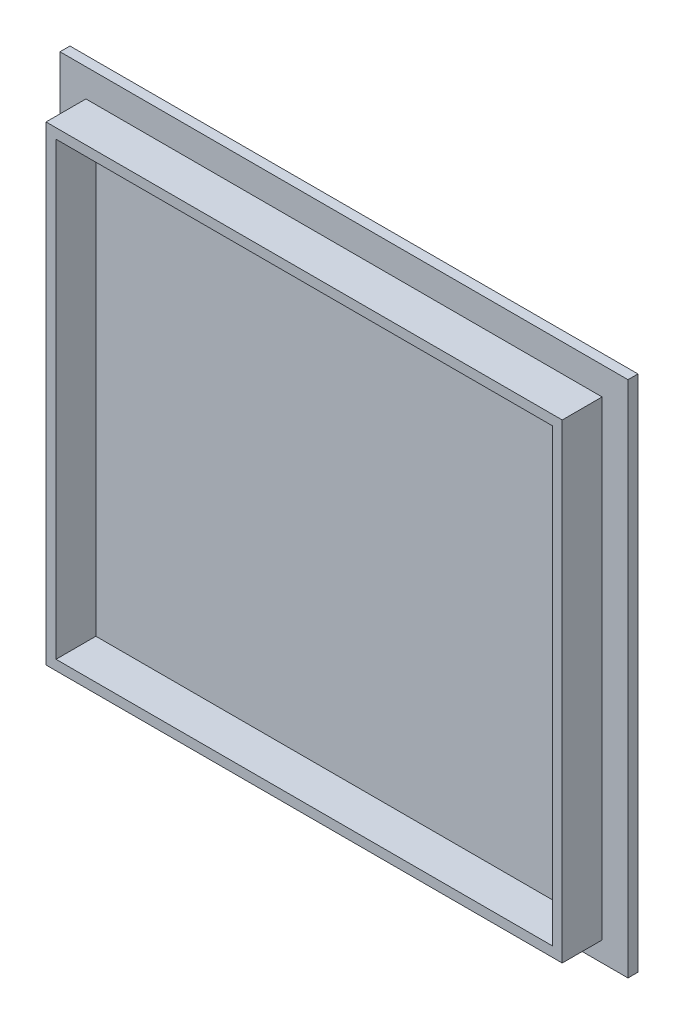
ISO-10303-21;
HEADER;
FILE_DESCRIPTION(('STEP AP214'),'2;1');
FILE_NAME('part.step','',(''),(''),'','','');
FILE_SCHEMA(('AUTOMOTIVE_DESIGN { 1 0 10303 214 1 1 1 1 }'));
ENDSEC;
DATA;
#1=APPLICATION_CONTEXT('core data for automotive mechanical design processes');
#2=APPLICATION_PROTOCOL_DEFINITION('international standard','automotive_design',2000,#1);
#3=PRODUCT_CONTEXT('',#1,'mechanical');
#4=PRODUCT('Part','Part','',(#3));
#5=PRODUCT_RELATED_PRODUCT_CATEGORY('part','',(#4));
#6=PRODUCT_DEFINITION_FORMATION('','',#4);
#7=PRODUCT_DEFINITION_CONTEXT('part definition',#1,'design');
#8=PRODUCT_DEFINITION('design','',#6,#7);
#9=PRODUCT_DEFINITION_SHAPE('','',#8);
#10=(LENGTH_UNIT() NAMED_UNIT(*) SI_UNIT(.MILLI.,.METRE.));
#11=(NAMED_UNIT(*) PLANE_ANGLE_UNIT() SI_UNIT($,.RADIAN.));
#12=(NAMED_UNIT(*) SI_UNIT($,.STERADIAN.) SOLID_ANGLE_UNIT());
#13=UNCERTAINTY_MEASURE_WITH_UNIT(LENGTH_MEASURE(1.E-05),#10,'distance_accuracy_value','');
#14=(GEOMETRIC_REPRESENTATION_CONTEXT(3) GLOBAL_UNCERTAINTY_ASSIGNED_CONTEXT((#13)) GLOBAL_UNIT_ASSIGNED_CONTEXT((#10,
#11,#12)) REPRESENTATION_CONTEXT('',''));
#15=CARTESIAN_POINT('',(0.,0.,0.));
#16=DIRECTION('',(0.,0.,1.));
#17=DIRECTION('',(1.,0.,0.));
#18=AXIS2_PLACEMENT_3D('',#15,#16,#17);
#19=CARTESIAN_POINT('',(-121.814520335947,173.047709923664,5.));
#20=DIRECTION('',(1.,0.,0.));
#21=DIRECTION('',(0.,1.,0.));
#22=AXIS2_PLACEMENT_3D('',#19,#20,#21);
#23=PLANE('',#22);
#24=DIRECTION('',(0.,-1.,0.));
#25=VECTOR('',#24,1.);
#26=CARTESIAN_POINT('',(-121.814520335947,173.047709923664,0.));
#27=LINE('',#26,#25);
#28=CARTESIAN_POINT('',(-121.814520335947,173.047709923664,0.));
#29=VERTEX_POINT('',#28);
#30=CARTESIAN_POINT('',(-121.814520335947,-86.9522900763359,0.));
#31=VERTEX_POINT('',#30);
#32=EDGE_CURVE('E195',#29,#31,#27,.T.);
#33=ORIENTED_EDGE('',*,*,#32,.T.);
#34=DIRECTION('',(0.,0.,-1.));
#35=VECTOR('',#34,1.);
#36=CARTESIAN_POINT('',(-121.814520335947,-86.9522900763359,5.));
#37=LINE('',#36,#35);
#38=CARTESIAN_POINT('',(-121.814520335947,-86.9522900763359,5.));
#39=VERTEX_POINT('',#38);
#40=EDGE_CURVE('E11',#39,#31,#37,.T.);
#41=ORIENTED_EDGE('',*,*,#40,.F.);
#42=DIRECTION('',(0.,-1.,0.));
#43=VECTOR('',#42,1.);
#44=CARTESIAN_POINT('',(-121.814520335947,173.047709923664,5.));
#45=LINE('',#44,#43);
#46=CARTESIAN_POINT('',(-121.814520335947,173.047709923664,5.));
#47=VERTEX_POINT('',#46);
#48=EDGE_CURVE('E196',#47,#39,#45,.T.);
#49=ORIENTED_EDGE('',*,*,#48,.F.);
#50=DIRECTION('',(0.,0.,-1.));
#51=VECTOR('',#50,1.);
#52=CARTESIAN_POINT('',(-121.814520335947,173.047709923664,5.));
#53=LINE('',#52,#51);
#54=EDGE_CURVE('E206',#47,#29,#53,.T.);
#55=ORIENTED_EDGE('',*,*,#54,.T.);
#56=EDGE_LOOP('',(#33,#41,#49,#55));
#57=FACE_BOUND('',#56,.T.);
#58=ADVANCED_FACE('F39',(#57),#23,.F.);
#59=CARTESIAN_POINT('',(-121.814520335947,-86.9522900763359,5.));
#60=DIRECTION('',(0.,1.,0.));
#61=DIRECTION('',(0.,0.,1.));
#62=AXIS2_PLACEMENT_3D('',#59,#60,#61);
#63=PLANE('',#62);
#64=DIRECTION('',(1.,0.,0.));
#65=VECTOR('',#64,1.);
#66=CARTESIAN_POINT('',(-121.814520335947,-86.9522900763359,0.));
#67=LINE('',#66,#65);
#68=CARTESIAN_POINT('',(163.185479664053,-86.9522900763359,0.));
#69=VERTEX_POINT('',#68);
#70=EDGE_CURVE('E209',#31,#69,#67,.T.);
#71=ORIENTED_EDGE('',*,*,#70,.T.);
#72=DIRECTION('',(0.,0.,-1.));
#73=VECTOR('',#72,1.);
#74=CARTESIAN_POINT('',(163.185479664053,-86.9522900763359,5.));
#75=LINE('',#74,#73);
#76=CARTESIAN_POINT('',(163.185479664053,-86.9522900763359,5.));
#77=VERTEX_POINT('',#76);
#78=EDGE_CURVE('E46',#77,#69,#75,.T.);
#79=ORIENTED_EDGE('',*,*,#78,.F.);
#80=DIRECTION('',(1.,0.,0.));
#81=VECTOR('',#80,1.);
#82=CARTESIAN_POINT('',(-121.814520335947,-86.9522900763359,5.));
#83=LINE('',#82,#81);
#84=EDGE_CURVE('E199',#39,#77,#83,.T.);
#85=ORIENTED_EDGE('',*,*,#84,.F.);
#86=ORIENTED_EDGE('',*,*,#40,.T.);
#87=EDGE_LOOP('',(#71,#79,#85,#86));
#88=FACE_BOUND('',#87,.T.);
#89=ADVANCED_FACE('F239',(#88),#63,.F.);
#90=CARTESIAN_POINT('',(163.185479664052,173.047709923664,5.));
#91=DIRECTION('',(-1.,0.,0.));
#92=DIRECTION('',(0.,-1.,0.));
#93=AXIS2_PLACEMENT_3D('',#90,#91,#92);
#94=PLANE('',#93);
#95=DIRECTION('',(0.,1.,0.));
#96=VECTOR('',#95,1.);
#97=CARTESIAN_POINT('',(163.185479664052,173.047709923664,0.));
#98=LINE('',#97,#96);
#99=CARTESIAN_POINT('',(163.185479664052,173.047709923664,0.));
#100=VERTEX_POINT('',#99);
#101=EDGE_CURVE('E211',#69,#100,#98,.T.);
#102=ORIENTED_EDGE('',*,*,#101,.T.);
#103=DIRECTION('',(0.,0.,-1.));
#104=VECTOR('',#103,1.);
#105=CARTESIAN_POINT('',(163.185479664052,173.047709923664,5.));
#106=LINE('',#105,#104);
#107=CARTESIAN_POINT('',(163.185479664052,173.047709923664,5.));
#108=VERTEX_POINT('',#107);
#109=EDGE_CURVE('E216',#108,#100,#106,.T.);
#110=ORIENTED_EDGE('',*,*,#109,.F.);
#111=DIRECTION('',(0.,1.,0.));
#112=VECTOR('',#111,1.);
#113=CARTESIAN_POINT('',(163.185479664052,173.047709923664,5.));
#114=LINE('',#113,#112);
#115=EDGE_CURVE('E202',#77,#108,#114,.T.);
#116=ORIENTED_EDGE('',*,*,#115,.F.);
#117=ORIENTED_EDGE('',*,*,#78,.T.);
#118=EDGE_LOOP('',(#102,#110,#116,#117));
#119=FACE_BOUND('',#118,.T.);
#120=ADVANCED_FACE('F223',(#119),#94,.F.);
#121=CARTESIAN_POINT('',(-121.814520335947,173.047709923664,5.));
#122=DIRECTION('',(0.,-1.,0.));
#123=DIRECTION('',(0.,0.,-1.));
#124=AXIS2_PLACEMENT_3D('',#121,#122,#123);
#125=PLANE('',#124);
#126=DIRECTION('',(-1.,0.,0.));
#127=VECTOR('',#126,1.);
#128=CARTESIAN_POINT('',(-121.814520335947,173.047709923664,0.));
#129=LINE('',#128,#127);
#130=EDGE_CURVE('E200',#100,#29,#129,.T.);
#131=ORIENTED_EDGE('',*,*,#130,.T.);
#132=ORIENTED_EDGE('',*,*,#54,.F.);
#133=DIRECTION('',(-1.,0.,0.));
#134=VECTOR('',#133,1.);
#135=CARTESIAN_POINT('',(-121.814520335947,173.047709923664,5.));
#136=LINE('',#135,#134);
#137=EDGE_CURVE('E204',#108,#47,#136,.T.);
#138=ORIENTED_EDGE('',*,*,#137,.F.);
#139=ORIENTED_EDGE('',*,*,#109,.T.);
#140=EDGE_LOOP('',(#131,#132,#138,#139));
#141=FACE_BOUND('',#140,.T.);
#142=ADVANCED_FACE('F232',(#141),#125,.F.);
#143=CARTESIAN_POINT('',(0.,0.,5.));
#144=DIRECTION('',(0.,0.,1.));
#145=DIRECTION('',(1.,0.,0.));
#146=AXIS2_PLACEMENT_3D('',#143,#144,#145);
#147=PLANE('',#146);
#148=DIRECTION('',(0.,-1.,0.));
#149=VECTOR('',#148,1.);
#150=CARTESIAN_POINT('',(-108.814520335947,159.047709923664,5.));
#151=LINE('',#150,#149);
#152=CARTESIAN_POINT('',(-108.814520335947,159.047709923664,5.));
#153=VERTEX_POINT('',#152);
#154=CARTESIAN_POINT('',(-108.814520335947,-76.9522900763359,5.));
#155=VERTEX_POINT('',#154);
#156=EDGE_CURVE('E61',#153,#155,#151,.T.);
#157=ORIENTED_EDGE('',*,*,#156,.F.);
#158=DIRECTION('',(-1.,0.,0.));
#159=VECTOR('',#158,1.);
#160=CARTESIAN_POINT('',(-108.814520335947,159.047709923664,5.));
#161=LINE('',#160,#159);
#162=CARTESIAN_POINT('',(150.185479664053,159.047709923664,5.));
#163=VERTEX_POINT('',#162);
#164=EDGE_CURVE('E169',#163,#153,#161,.T.);
#165=ORIENTED_EDGE('',*,*,#164,.F.);
#166=DIRECTION('',(0.,1.,0.));
#167=VECTOR('',#166,1.);
#168=CARTESIAN_POINT('',(150.185479664053,159.047709923664,5.));
#169=LINE('',#168,#167);
#170=CARTESIAN_POINT('',(150.185479664053,-76.9522900763359,5.));
#171=VERTEX_POINT('',#170);
#172=EDGE_CURVE('E180',#171,#163,#169,.T.);
#173=ORIENTED_EDGE('',*,*,#172,.F.);
#174=DIRECTION('',(1.,0.,0.));
#175=VECTOR('',#174,1.);
#176=CARTESIAN_POINT('',(-108.814520335947,-76.9522900763359,5.));
#177=LINE('',#176,#175);
#178=EDGE_CURVE('E177',#155,#171,#177,.T.);
#179=ORIENTED_EDGE('',*,*,#178,.F.);
#180=EDGE_LOOP('',(#157,#165,#173,#179));
#181=FACE_BOUND('',#180,.T.);
#182=ORIENTED_EDGE('',*,*,#48,.T.);
#183=ORIENTED_EDGE('',*,*,#84,.T.);
#184=ORIENTED_EDGE('',*,*,#115,.T.);
#185=ORIENTED_EDGE('',*,*,#137,.T.);
#186=EDGE_LOOP('',(#182,#183,#184,#185));
#187=FACE_BOUND('',#186,.T.);
#188=ADVANCED_FACE('F238',(#181,#187),#147,.T.);
#189=CARTESIAN_POINT('',(0.,0.,0.));
#190=DIRECTION('',(0.,0.,1.));
#191=DIRECTION('',(1.,0.,0.));
#192=AXIS2_PLACEMENT_3D('',#189,#190,#191);
#193=PLANE('',#192);
#194=ORIENTED_EDGE('',*,*,#32,.F.);
#195=ORIENTED_EDGE('',*,*,#130,.F.);
#196=ORIENTED_EDGE('',*,*,#101,.F.);
#197=ORIENTED_EDGE('',*,*,#70,.F.);
#198=EDGE_LOOP('',(#194,#195,#196,#197));
#199=FACE_BOUND('',#198,.T.);
#200=ADVANCED_FACE('F229',(#199),#193,.F.);
#201=CARTESIAN_POINT('',(-108.814520335947,159.047709923664,25.));
#202=DIRECTION('',(1.,0.,0.));
#203=DIRECTION('',(0.,1.,0.));
#204=AXIS2_PLACEMENT_3D('',#201,#202,#203);
#205=PLANE('',#204);
#206=ORIENTED_EDGE('',*,*,#156,.T.);
#207=DIRECTION('',(0.,0.,-1.));
#208=VECTOR('',#207,1.);
#209=CARTESIAN_POINT('',(-108.814520335947,-76.9522900763359,25.));
#210=LINE('',#209,#208);
#211=CARTESIAN_POINT('',(-108.814520335947,-76.9522900763359,25.));
#212=VERTEX_POINT('',#211);
#213=EDGE_CURVE('E192',#212,#155,#210,.T.);
#214=ORIENTED_EDGE('',*,*,#213,.F.);
#215=DIRECTION('',(0.,-1.,0.));
#216=VECTOR('',#215,1.);
#217=CARTESIAN_POINT('',(-108.814520335947,159.047709923664,25.));
#218=LINE('',#217,#216);
#219=CARTESIAN_POINT('',(-108.814520335947,159.047709923664,25.));
#220=VERTEX_POINT('',#219);
#221=EDGE_CURVE('E165',#220,#212,#218,.T.);
#222=ORIENTED_EDGE('',*,*,#221,.F.);
#223=DIRECTION('',(0.,0.,-1.));
#224=VECTOR('',#223,1.);
#225=CARTESIAN_POINT('',(-108.814520335947,159.047709923664,25.));
#226=LINE('',#225,#224);
#227=EDGE_CURVE('E175',#220,#153,#226,.T.);
#228=ORIENTED_EDGE('',*,*,#227,.T.);
#229=EDGE_LOOP('',(#206,#214,#222,#228));
#230=FACE_BOUND('',#229,.T.);
#231=ADVANCED_FACE('F251',(#230),#205,.F.);
#232=CARTESIAN_POINT('',(-108.814520335947,-76.9522900763359,25.));
#233=DIRECTION('',(0.,1.,0.));
#234=DIRECTION('',(0.,0.,1.));
#235=AXIS2_PLACEMENT_3D('',#232,#233,#234);
#236=PLANE('',#235);
#237=ORIENTED_EDGE('',*,*,#178,.T.);
#238=DIRECTION('',(0.,0.,-1.));
#239=VECTOR('',#238,1.);
#240=CARTESIAN_POINT('',(150.185479664053,-76.9522900763359,25.));
#241=LINE('',#240,#239);
#242=CARTESIAN_POINT('',(150.185479664053,-76.9522900763359,25.));
#243=VERTEX_POINT('',#242);
#244=EDGE_CURVE('E189',#243,#171,#241,.T.);
#245=ORIENTED_EDGE('',*,*,#244,.F.);
#246=DIRECTION('',(1.,0.,0.));
#247=VECTOR('',#246,1.);
#248=CARTESIAN_POINT('',(-108.814520335947,-76.9522900763359,25.));
#249=LINE('',#248,#247);
#250=EDGE_CURVE('E168',#212,#243,#249,.T.);
#251=ORIENTED_EDGE('',*,*,#250,.F.);
#252=ORIENTED_EDGE('',*,*,#213,.T.);
#253=EDGE_LOOP('',(#237,#245,#251,#252));
#254=FACE_BOUND('',#253,.T.);
#255=ADVANCED_FACE('F256',(#254),#236,.F.);
#256=CARTESIAN_POINT('',(150.185479664053,159.047709923664,25.));
#257=DIRECTION('',(-1.,0.,0.));
#258=DIRECTION('',(0.,-1.,0.));
#259=AXIS2_PLACEMENT_3D('',#256,#257,#258);
#260=PLANE('',#259);
#261=ORIENTED_EDGE('',*,*,#172,.T.);
#262=DIRECTION('',(0.,0.,-1.));
#263=VECTOR('',#262,1.);
#264=CARTESIAN_POINT('',(150.185479664053,159.047709923664,25.));
#265=LINE('',#264,#263);
#266=CARTESIAN_POINT('',(150.185479664053,159.047709923664,25.));
#267=VERTEX_POINT('',#266);
#268=EDGE_CURVE('E186',#267,#163,#265,.T.);
#269=ORIENTED_EDGE('',*,*,#268,.F.);
#270=DIRECTION('',(0.,1.,0.));
#271=VECTOR('',#270,1.);
#272=CARTESIAN_POINT('',(150.185479664053,159.047709923664,25.));
#273=LINE('',#272,#271);
#274=EDGE_CURVE('E171',#243,#267,#273,.T.);
#275=ORIENTED_EDGE('',*,*,#274,.F.);
#276=ORIENTED_EDGE('',*,*,#244,.T.);
#277=EDGE_LOOP('',(#261,#269,#275,#276));
#278=FACE_BOUND('',#277,.T.);
#279=ADVANCED_FACE('F260',(#278),#260,.F.);
#280=CARTESIAN_POINT('',(-108.814520335947,159.047709923664,25.));
#281=DIRECTION('',(0.,-1.,0.));
#282=DIRECTION('',(0.,0.,-1.));
#283=AXIS2_PLACEMENT_3D('',#280,#281,#282);
#284=PLANE('',#283);
#285=ORIENTED_EDGE('',*,*,#164,.T.);
#286=ORIENTED_EDGE('',*,*,#227,.F.);
#287=DIRECTION('',(-1.,0.,0.));
#288=VECTOR('',#287,1.);
#289=CARTESIAN_POINT('',(-108.814520335947,159.047709923664,25.));
#290=LINE('',#289,#288);
#291=EDGE_CURVE('E173',#267,#220,#290,.T.);
#292=ORIENTED_EDGE('',*,*,#291,.F.);
#293=ORIENTED_EDGE('',*,*,#268,.T.);
#294=EDGE_LOOP('',(#285,#286,#292,#293));
#295=FACE_BOUND('',#294,.T.);
#296=ADVANCED_FACE('F264',(#295),#284,.F.);
#297=CARTESIAN_POINT('',(0.,0.,25.));
#298=DIRECTION('',(0.,0.,1.));
#299=DIRECTION('',(1.,0.,0.));
#300=AXIS2_PLACEMENT_3D('',#297,#298,#299);
#301=PLANE('',#300);
#302=DIRECTION('',(0.,-1.,0.));
#303=VECTOR('',#302,1.);
#304=CARTESIAN_POINT('',(-103.814520335947,154.047709923664,25.));
#305=LINE('',#304,#303);
#306=CARTESIAN_POINT('',(-103.814520335947,154.047709923664,25.));
#307=VERTEX_POINT('',#306);
#308=CARTESIAN_POINT('',(-103.814520335947,-71.9522900763359,25.));
#309=VERTEX_POINT('',#308);
#310=EDGE_CURVE('E53',#307,#309,#305,.T.);
#311=ORIENTED_EDGE('',*,*,#310,.F.);
#312=DIRECTION('',(-1.,0.,0.));
#313=VECTOR('',#312,1.);
#314=CARTESIAN_POINT('',(-103.814520335947,154.047709923664,25.));
#315=LINE('',#314,#313);
#316=CARTESIAN_POINT('',(145.185479664053,154.047709923664,25.));
#317=VERTEX_POINT('',#316);
#318=EDGE_CURVE('E147',#317,#307,#315,.T.);
#319=ORIENTED_EDGE('',*,*,#318,.F.);
#320=DIRECTION('',(0.,1.,0.));
#321=VECTOR('',#320,1.);
#322=CARTESIAN_POINT('',(145.185479664053,154.047709923664,25.));
#323=LINE('',#322,#321);
#324=CARTESIAN_POINT('',(145.185479664053,-71.9522900763359,25.));
#325=VERTEX_POINT('',#324);
#326=EDGE_CURVE('E150',#325,#317,#323,.T.);
#327=ORIENTED_EDGE('',*,*,#326,.F.);
#328=DIRECTION('',(1.,0.,0.));
#329=VECTOR('',#328,1.);
#330=CARTESIAN_POINT('',(-103.814520335947,-71.9522900763359,25.));
#331=LINE('',#330,#329);
#332=EDGE_CURVE('E156',#309,#325,#331,.T.);
#333=ORIENTED_EDGE('',*,*,#332,.F.);
#334=EDGE_LOOP('',(#311,#319,#327,#333));
#335=FACE_BOUND('',#334,.T.);
#336=ORIENTED_EDGE('',*,*,#221,.T.);
#337=ORIENTED_EDGE('',*,*,#250,.T.);
#338=ORIENTED_EDGE('',*,*,#274,.T.);
#339=ORIENTED_EDGE('',*,*,#291,.T.);
#340=EDGE_LOOP('',(#336,#337,#338,#339));
#341=FACE_BOUND('',#340,.T.);
#342=ADVANCED_FACE('F268',(#335,#341),#301,.T.);
#343=CARTESIAN_POINT('',(-103.814520335947,154.047709923664,5.));
#344=DIRECTION('',(-1.,0.,0.));
#345=DIRECTION('',(0.,-1.,0.));
#346=AXIS2_PLACEMENT_3D('',#343,#344,#345);
#347=PLANE('',#346);
#348=ORIENTED_EDGE('',*,*,#310,.T.);
#349=DIRECTION('',(0.,0.,1.));
#350=VECTOR('',#349,1.);
#351=CARTESIAN_POINT('',(-103.814520335947,-71.9522900763359,5.));
#352=LINE('',#351,#350);
#353=CARTESIAN_POINT('',(-103.814520335947,-71.9522900763359,5.));
#354=VERTEX_POINT('',#353);
#355=EDGE_CURVE('E125',#354,#309,#352,.T.);
#356=ORIENTED_EDGE('',*,*,#355,.F.);
#357=DIRECTION('',(0.,-1.,0.));
#358=VECTOR('',#357,1.);
#359=CARTESIAN_POINT('',(-103.814520335947,154.047709923664,5.));
#360=LINE('',#359,#358);
#361=CARTESIAN_POINT('',(-103.814520335947,154.047709923664,5.));
#362=VERTEX_POINT('',#361);
#363=EDGE_CURVE('E129',#362,#354,#360,.T.);
#364=ORIENTED_EDGE('',*,*,#363,.F.);
#365=DIRECTION('',(0.,0.,1.));
#366=VECTOR('',#365,1.);
#367=CARTESIAN_POINT('',(-103.814520335947,154.047709923664,5.));
#368=LINE('',#367,#366);
#369=EDGE_CURVE('E160',#362,#307,#368,.T.);
#370=ORIENTED_EDGE('',*,*,#369,.T.);
#371=EDGE_LOOP('',(#348,#356,#364,#370));
#372=FACE_BOUND('',#371,.T.);
#373=ADVANCED_FACE('F127',(#372),#347,.F.);
#374=CARTESIAN_POINT('',(-103.814520335947,154.047709923664,5.));
#375=DIRECTION('',(0.,1.,0.));
#376=DIRECTION('',(0.,0.,1.));
#377=AXIS2_PLACEMENT_3D('',#374,#375,#376);
#378=PLANE('',#377);
#379=ORIENTED_EDGE('',*,*,#318,.T.);
#380=ORIENTED_EDGE('',*,*,#369,.F.);
#381=DIRECTION('',(-1.,0.,0.));
#382=VECTOR('',#381,1.);
#383=CARTESIAN_POINT('',(-103.814520335947,154.047709923664,5.));
#384=LINE('',#383,#382);
#385=CARTESIAN_POINT('',(145.185479664053,154.047709923664,5.));
#386=VERTEX_POINT('',#385);
#387=EDGE_CURVE('E135',#386,#362,#384,.T.);
#388=ORIENTED_EDGE('',*,*,#387,.F.);
#389=DIRECTION('',(0.,0.,1.));
#390=VECTOR('',#389,1.);
#391=CARTESIAN_POINT('',(145.185479664053,154.047709923664,5.));
#392=LINE('',#391,#390);
#393=EDGE_CURVE('E162',#386,#317,#392,.T.);
#394=ORIENTED_EDGE('',*,*,#393,.T.);
#395=EDGE_LOOP('',(#379,#380,#388,#394));
#396=FACE_BOUND('',#395,.T.);
#397=ADVANCED_FACE('F275',(#396),#378,.F.);
#398=CARTESIAN_POINT('',(145.185479664053,154.047709923664,5.));
#399=DIRECTION('',(1.,0.,0.));
#400=DIRECTION('',(0.,1.,0.));
#401=AXIS2_PLACEMENT_3D('',#398,#399,#400);
#402=PLANE('',#401);
#403=ORIENTED_EDGE('',*,*,#326,.T.);
#404=ORIENTED_EDGE('',*,*,#393,.F.);
#405=DIRECTION('',(0.,1.,0.));
#406=VECTOR('',#405,1.);
#407=CARTESIAN_POINT('',(145.185479664053,154.047709923664,5.));
#408=LINE('',#407,#406);
#409=CARTESIAN_POINT('',(145.185479664053,-71.9522900763359,5.));
#410=VERTEX_POINT('',#409);
#411=EDGE_CURVE('E143',#410,#386,#408,.T.);
#412=ORIENTED_EDGE('',*,*,#411,.F.);
#413=DIRECTION('',(0.,0.,1.));
#414=VECTOR('',#413,1.);
#415=CARTESIAN_POINT('',(145.185479664053,-71.9522900763359,5.));
#416=LINE('',#415,#414);
#417=EDGE_CURVE('E134',#410,#325,#416,.T.);
#418=ORIENTED_EDGE('',*,*,#417,.T.);
#419=EDGE_LOOP('',(#403,#404,#412,#418));
#420=FACE_BOUND('',#419,.T.);
#421=ADVANCED_FACE('F278',(#420),#402,.F.);
#422=CARTESIAN_POINT('',(-103.814520335947,-71.9522900763359,5.));
#423=DIRECTION('',(0.,-1.,0.));
#424=DIRECTION('',(0.,0.,-1.));
#425=AXIS2_PLACEMENT_3D('',#422,#423,#424);
#426=PLANE('',#425);
#427=ORIENTED_EDGE('',*,*,#332,.T.);
#428=ORIENTED_EDGE('',*,*,#417,.F.);
#429=DIRECTION('',(1.,0.,0.));
#430=VECTOR('',#429,1.);
#431=CARTESIAN_POINT('',(-103.814520335947,-71.9522900763359,5.));
#432=LINE('',#431,#430);
#433=EDGE_CURVE('E138',#354,#410,#432,.T.);
#434=ORIENTED_EDGE('',*,*,#433,.F.);
#435=ORIENTED_EDGE('',*,*,#355,.T.);
#436=EDGE_LOOP('',(#427,#428,#434,#435));
#437=FACE_BOUND('',#436,.T.);
#438=ADVANCED_FACE('F139',(#437),#426,.F.);
#439=CARTESIAN_POINT('',(0.,0.,5.));
#440=DIRECTION('',(0.,0.,1.));
#441=DIRECTION('',(1.,0.,0.));
#442=AXIS2_PLACEMENT_3D('',#439,#440,#441);
#443=PLANE('',#442);
#444=ORIENTED_EDGE('',*,*,#363,.T.);
#445=ORIENTED_EDGE('',*,*,#433,.T.);
#446=ORIENTED_EDGE('',*,*,#411,.T.);
#447=ORIENTED_EDGE('',*,*,#387,.T.);
#448=EDGE_LOOP('',(#444,#445,#446,#447));
#449=FACE_BOUND('',#448,.T.);
#450=ADVANCED_FACE('F145',(#449),#443,.T.);
#451=CLOSED_SHELL('',(#58,#89,#120,#142,#188,#200,#231,#255,#279,#296,#342,#373,#397,#421,#438,#450));
#452=MANIFOLD_SOLID_BREP('B2',#451);
#453=ADVANCED_BREP_SHAPE_REPRESENTATION('',(#18,#452),#14);
#454=SHAPE_DEFINITION_REPRESENTATION(#9,#453);
ENDSEC;
END-ISO-10303-21;
